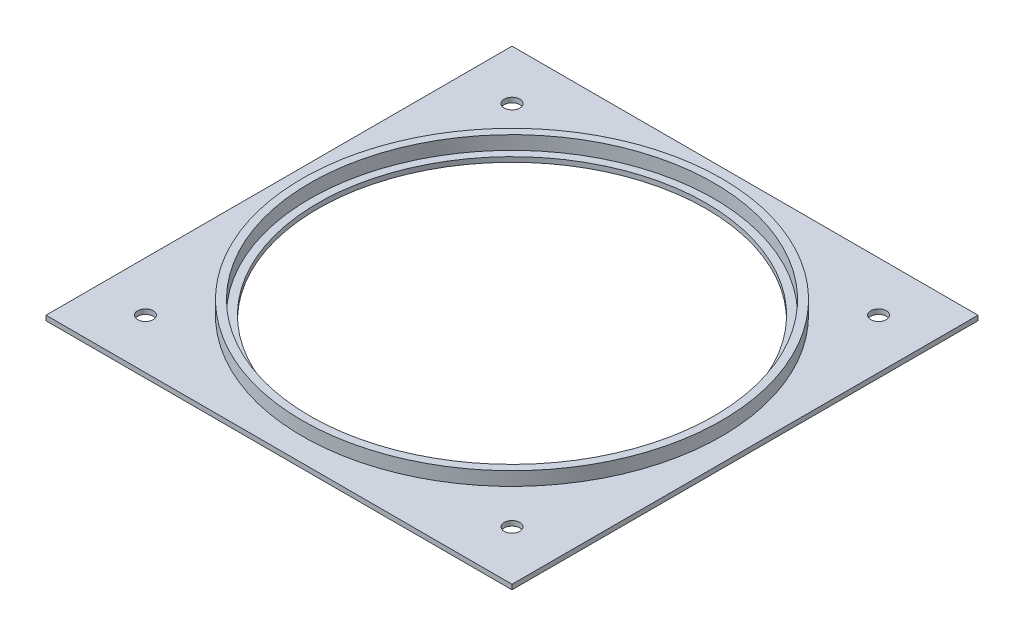
ISO-10303-21;
HEADER;
FILE_DESCRIPTION(('STEP AP214'),'2;1');
FILE_NAME('part.step','',(''),(''),'','','');
FILE_SCHEMA(('AUTOMOTIVE_DESIGN { 1 0 10303 214 1 1 1 1 }'));
ENDSEC;
DATA;
#1=APPLICATION_CONTEXT('core data for automotive mechanical design processes');
#2=APPLICATION_PROTOCOL_DEFINITION('international standard','automotive_design',2000,#1);
#3=PRODUCT_CONTEXT('',#1,'mechanical');
#4=PRODUCT('Part','Part','',(#3));
#5=PRODUCT_RELATED_PRODUCT_CATEGORY('part','',(#4));
#6=PRODUCT_DEFINITION_FORMATION('','',#4);
#7=PRODUCT_DEFINITION_CONTEXT('part definition',#1,'design');
#8=PRODUCT_DEFINITION('design','',#6,#7);
#9=PRODUCT_DEFINITION_SHAPE('','',#8);
#10=(LENGTH_UNIT() NAMED_UNIT(*) SI_UNIT(.MILLI.,.METRE.));
#11=(NAMED_UNIT(*) PLANE_ANGLE_UNIT() SI_UNIT($,.RADIAN.));
#12=(NAMED_UNIT(*) SI_UNIT($,.STERADIAN.) SOLID_ANGLE_UNIT());
#13=UNCERTAINTY_MEASURE_WITH_UNIT(LENGTH_MEASURE(1.E-05),#10,'distance_accuracy_value','');
#14=(GEOMETRIC_REPRESENTATION_CONTEXT(3) GLOBAL_UNCERTAINTY_ASSIGNED_CONTEXT((#13)) GLOBAL_UNIT_ASSIGNED_CONTEXT((#10,
#11,#12)) REPRESENTATION_CONTEXT('',''));
#15=CARTESIAN_POINT('',(0.,0.,0.));
#16=DIRECTION('',(0.,0.,1.));
#17=DIRECTION('',(1.,0.,0.));
#18=AXIS2_PLACEMENT_3D('',#15,#16,#17);
#19=CARTESIAN_POINT('',(0.,1.5875,0.));
#20=DIRECTION('',(0.,-1.,0.));
#21=DIRECTION('',(0.,0.,-1.));
#22=AXIS2_PLACEMENT_3D('',#19,#20,#21);
#23=PLANE('',#22);
#24=CARTESIAN_POINT('',(0.,1.5875,0.));
#25=DIRECTION('',(0.,1.,0.));
#26=DIRECTION('',(0.,0.,1.));
#27=AXIS2_PLACEMENT_3D('',#24,#25,#26);
#28=CIRCLE('',#27,63.5);
#29=CARTESIAN_POINT('',(0.,1.5875,63.5));
#30=VERTEX_POINT('',#29);
#31=EDGE_CURVE('E110',#30,#30,#28,.T.);
#32=ORIENTED_EDGE('',*,*,#31,.F.);
#33=EDGE_LOOP('',(#32));
#34=FACE_BOUND('',#33,.T.);
#35=CARTESIAN_POINT('',(0.,1.5875,0.));
#36=DIRECTION('',(0.,1.,0.));
#37=DIRECTION('',(0.,0.,1.));
#38=AXIS2_PLACEMENT_3D('',#35,#36,#37);
#39=CIRCLE('',#38,66.04);
#40=CARTESIAN_POINT('',(0.,1.5875,66.04));
#41=VERTEX_POINT('',#40);
#42=EDGE_CURVE('E173',#41,#41,#39,.T.);
#43=ORIENTED_EDGE('',*,*,#42,.T.);
#44=EDGE_LOOP('',(#43));
#45=FACE_BOUND('',#44,.T.);
#46=ADVANCED_FACE('F39',(#34,#45),#23,.F.);
#47=CARTESIAN_POINT('',(0.,1.5875,0.));
#48=DIRECTION('',(0.,-1.,0.));
#49=DIRECTION('',(0.,0.,-1.));
#50=AXIS2_PLACEMENT_3D('',#47,#48,#49);
#51=CIRCLE('',#50,68.58);
#52=CARTESIAN_POINT('',(0.,1.5875,-68.58));
#53=VERTEX_POINT('',#52);
#54=EDGE_CURVE('E11',#53,#53,#51,.F.);
#55=ORIENTED_EDGE('',*,*,#54,.F.);
#56=EDGE_LOOP('',(#55));
#57=FACE_BOUND('',#56,.T.);
#58=DIRECTION('',(0.,0.,-1.));
#59=VECTOR('',#58,1.);
#60=CARTESIAN_POINT('',(76.2,1.5875,76.2));
#61=LINE('',#60,#59);
#62=CARTESIAN_POINT('',(76.2,1.5875,76.2));
#63=VERTEX_POINT('',#62);
#64=CARTESIAN_POINT('',(76.2,1.5875,-76.2));
#65=VERTEX_POINT('',#64);
#66=EDGE_CURVE('E93',#63,#65,#61,.T.);
#67=ORIENTED_EDGE('',*,*,#66,.T.);
#68=DIRECTION('',(-1.,0.,0.));
#69=VECTOR('',#68,1.);
#70=CARTESIAN_POINT('',(-76.2,1.5875,-76.2));
#71=LINE('',#70,#69);
#72=CARTESIAN_POINT('',(-76.2,1.5875,-76.2));
#73=VERTEX_POINT('',#72);
#74=EDGE_CURVE('E87',#65,#73,#71,.T.);
#75=ORIENTED_EDGE('',*,*,#74,.T.);
#76=DIRECTION('',(0.,0.,1.));
#77=VECTOR('',#76,1.);
#78=CARTESIAN_POINT('',(-76.2,1.5875,76.2));
#79=LINE('',#78,#77);
#80=CARTESIAN_POINT('',(-76.2,1.5875,76.2));
#81=VERTEX_POINT('',#80);
#82=EDGE_CURVE('E91',#73,#81,#79,.T.);
#83=ORIENTED_EDGE('',*,*,#82,.T.);
#84=DIRECTION('',(1.,0.,0.));
#85=VECTOR('',#84,1.);
#86=CARTESIAN_POINT('',(-76.2,1.5875,76.2));
#87=LINE('',#86,#85);
#88=EDGE_CURVE('E56',#81,#63,#87,.T.);
#89=ORIENTED_EDGE('',*,*,#88,.T.);
#90=EDGE_LOOP('',(#67,#75,#83,#89));
#91=FACE_BOUND('',#90,.T.);
#92=CARTESIAN_POINT('',(-59.944,1.5875,-59.944));
#93=DIRECTION('',(0.,1.,0.));
#94=DIRECTION('',(0.,0.,1.));
#95=AXIS2_PLACEMENT_3D('',#92,#93,#94);
#96=CIRCLE('',#95,2.54);
#97=CARTESIAN_POINT('',(-59.944,1.5875,-57.404));
#98=VERTEX_POINT('',#97);
#99=EDGE_CURVE('E156',#98,#98,#96,.T.);
#100=ORIENTED_EDGE('',*,*,#99,.F.);
#101=EDGE_LOOP('',(#100));
#102=FACE_BOUND('',#101,.T.);
#103=CARTESIAN_POINT('',(59.944,1.5875,-59.944));
#104=DIRECTION('',(0.,1.,0.));
#105=DIRECTION('',(0.,0.,1.));
#106=AXIS2_PLACEMENT_3D('',#103,#104,#105);
#107=CIRCLE('',#106,2.54);
#108=CARTESIAN_POINT('',(59.944,1.5875,-57.404));
#109=VERTEX_POINT('',#108);
#110=EDGE_CURVE('E151',#109,#109,#107,.T.);
#111=ORIENTED_EDGE('',*,*,#110,.F.);
#112=EDGE_LOOP('',(#111));
#113=FACE_BOUND('',#112,.T.);
#114=CARTESIAN_POINT('',(59.944,1.5875,59.944));
#115=DIRECTION('',(0.,1.,0.));
#116=DIRECTION('',(0.,0.,1.));
#117=AXIS2_PLACEMENT_3D('',#114,#115,#116);
#118=CIRCLE('',#117,2.54);
#119=CARTESIAN_POINT('',(59.944,1.5875,62.484));
#120=VERTEX_POINT('',#119);
#121=EDGE_CURVE('E146',#120,#120,#118,.T.);
#122=ORIENTED_EDGE('',*,*,#121,.F.);
#123=EDGE_LOOP('',(#122));
#124=FACE_BOUND('',#123,.T.);
#125=CARTESIAN_POINT('',(-59.944,1.5875,59.944));
#126=DIRECTION('',(0.,1.,0.));
#127=DIRECTION('',(0.,0.,1.));
#128=AXIS2_PLACEMENT_3D('',#125,#126,#127);
#129=CIRCLE('',#128,2.54);
#130=CARTESIAN_POINT('',(-59.944,1.5875,62.484));
#131=VERTEX_POINT('',#130);
#132=EDGE_CURVE('E135',#131,#131,#129,.T.);
#133=ORIENTED_EDGE('',*,*,#132,.F.);
#134=EDGE_LOOP('',(#133));
#135=FACE_BOUND('',#134,.T.);
#136=ADVANCED_FACE('F88',(#57,#91,#102,#113,#124,#135),#23,.F.);
#137=CARTESIAN_POINT('',(0.,0.,0.));
#138=DIRECTION('',(0.,-1.,0.));
#139=DIRECTION('',(0.,0.,-1.));
#140=AXIS2_PLACEMENT_3D('',#137,#138,#139);
#141=PLANE('',#140);
#142=CARTESIAN_POINT('',(59.944,0.,59.944));
#143=DIRECTION('',(0.,1.,0.));
#144=DIRECTION('',(0.,0.,1.));
#145=AXIS2_PLACEMENT_3D('',#142,#143,#144);
#146=CIRCLE('',#145,2.54);
#147=CARTESIAN_POINT('',(59.944,0.,62.484));
#148=VERTEX_POINT('',#147);
#149=EDGE_CURVE('E139',#148,#148,#146,.T.);
#150=ORIENTED_EDGE('',*,*,#149,.T.);
#151=EDGE_LOOP('',(#150));
#152=FACE_BOUND('',#151,.T.);
#153=CARTESIAN_POINT('',(-59.944,0.,-59.944));
#154=DIRECTION('',(0.,1.,0.));
#155=DIRECTION('',(0.,0.,1.));
#156=AXIS2_PLACEMENT_3D('',#153,#154,#155);
#157=CIRCLE('',#156,2.54);
#158=CARTESIAN_POINT('',(-59.944,0.,-57.404));
#159=VERTEX_POINT('',#158);
#160=EDGE_CURVE('E154',#159,#159,#157,.T.);
#161=ORIENTED_EDGE('',*,*,#160,.T.);
#162=EDGE_LOOP('',(#161));
#163=FACE_BOUND('',#162,.T.);
#164=DIRECTION('',(0.,0.,-1.));
#165=VECTOR('',#164,1.);
#166=CARTESIAN_POINT('',(76.2,0.,76.2));
#167=LINE('',#166,#165);
#168=CARTESIAN_POINT('',(76.2,0.,76.2));
#169=VERTEX_POINT('',#168);
#170=CARTESIAN_POINT('',(76.2,0.,-76.2));
#171=VERTEX_POINT('',#170);
#172=EDGE_CURVE('E107',#169,#171,#167,.T.);
#173=ORIENTED_EDGE('',*,*,#172,.F.);
#174=DIRECTION('',(1.,0.,0.));
#175=VECTOR('',#174,1.);
#176=CARTESIAN_POINT('',(-76.2,0.,76.2));
#177=LINE('',#176,#175);
#178=CARTESIAN_POINT('',(-76.2,0.,76.2));
#179=VERTEX_POINT('',#178);
#180=EDGE_CURVE('E79',#179,#169,#177,.T.);
#181=ORIENTED_EDGE('',*,*,#180,.F.);
#182=DIRECTION('',(0.,0.,1.));
#183=VECTOR('',#182,1.);
#184=CARTESIAN_POINT('',(-76.2,0.,76.2));
#185=LINE('',#184,#183);
#186=CARTESIAN_POINT('',(-76.2,0.,-76.2));
#187=VERTEX_POINT('',#186);
#188=EDGE_CURVE('E73',#187,#179,#185,.T.);
#189=ORIENTED_EDGE('',*,*,#188,.F.);
#190=DIRECTION('',(-1.,0.,0.));
#191=VECTOR('',#190,1.);
#192=CARTESIAN_POINT('',(-76.2,0.,-76.2));
#193=LINE('',#192,#191);
#194=EDGE_CURVE('E98',#171,#187,#193,.T.);
#195=ORIENTED_EDGE('',*,*,#194,.F.);
#196=EDGE_LOOP('',(#173,#181,#189,#195));
#197=FACE_BOUND('',#196,.T.);
#198=CARTESIAN_POINT('',(0.,0.,0.));
#199=DIRECTION('',(0.,1.,0.));
#200=DIRECTION('',(0.,0.,1.));
#201=AXIS2_PLACEMENT_3D('',#198,#199,#200);
#202=CIRCLE('',#201,63.5);
#203=CARTESIAN_POINT('',(0.,0.,63.5));
#204=VERTEX_POINT('',#203);
#205=EDGE_CURVE('E126',#204,#204,#202,.T.);
#206=ORIENTED_EDGE('',*,*,#205,.T.);
#207=EDGE_LOOP('',(#206));
#208=FACE_BOUND('',#207,.T.);
#209=CARTESIAN_POINT('',(59.944,0.,-59.944));
#210=DIRECTION('',(0.,1.,0.));
#211=DIRECTION('',(0.,0.,1.));
#212=AXIS2_PLACEMENT_3D('',#209,#210,#211);
#213=CIRCLE('',#212,2.54);
#214=CARTESIAN_POINT('',(59.944,0.,-57.404));
#215=VERTEX_POINT('',#214);
#216=EDGE_CURVE('E130',#215,#215,#213,.T.);
#217=ORIENTED_EDGE('',*,*,#216,.T.);
#218=EDGE_LOOP('',(#217));
#219=FACE_BOUND('',#218,.T.);
#220=CARTESIAN_POINT('',(-59.944,0.,59.944));
#221=DIRECTION('',(0.,1.,0.));
#222=DIRECTION('',(0.,0.,1.));
#223=AXIS2_PLACEMENT_3D('',#220,#221,#222);
#224=CIRCLE('',#223,2.54);
#225=CARTESIAN_POINT('',(-59.944,0.,62.484));
#226=VERTEX_POINT('',#225);
#227=EDGE_CURVE('E133',#226,#226,#224,.T.);
#228=ORIENTED_EDGE('',*,*,#227,.T.);
#229=EDGE_LOOP('',(#228));
#230=FACE_BOUND('',#229,.T.);
#231=ADVANCED_FACE('F118',(#152,#163,#197,#208,#219,#230),#141,.T.);
#232=CARTESIAN_POINT('',(76.2,1.5875,76.2));
#233=DIRECTION('',(-1.,0.,0.));
#234=DIRECTION('',(0.,0.,1.));
#235=AXIS2_PLACEMENT_3D('',#232,#233,#234);
#236=PLANE('',#235);
#237=ORIENTED_EDGE('',*,*,#172,.T.);
#238=DIRECTION('',(0.,-1.,0.));
#239=VECTOR('',#238,1.);
#240=CARTESIAN_POINT('',(76.2,1.5875,-76.2));
#241=LINE('',#240,#239);
#242=EDGE_CURVE('E48',#65,#171,#241,.T.);
#243=ORIENTED_EDGE('',*,*,#242,.F.);
#244=ORIENTED_EDGE('',*,*,#66,.F.);
#245=DIRECTION('',(0.,-1.,0.));
#246=VECTOR('',#245,1.);
#247=CARTESIAN_POINT('',(76.2,1.5875,76.2));
#248=LINE('',#247,#246);
#249=EDGE_CURVE('E103',#63,#169,#248,.T.);
#250=ORIENTED_EDGE('',*,*,#249,.T.);
#251=EDGE_LOOP('',(#237,#243,#244,#250));
#252=FACE_BOUND('',#251,.T.);
#253=ADVANCED_FACE('F41',(#252),#236,.F.);
#254=CARTESIAN_POINT('',(-76.2,1.5875,-76.2));
#255=DIRECTION('',(0.,0.,1.));
#256=DIRECTION('',(1.,0.,0.));
#257=AXIS2_PLACEMENT_3D('',#254,#255,#256);
#258=PLANE('',#257);
#259=ORIENTED_EDGE('',*,*,#194,.T.);
#260=DIRECTION('',(0.,-1.,0.));
#261=VECTOR('',#260,1.);
#262=CARTESIAN_POINT('',(-76.2,1.5875,-76.2));
#263=LINE('',#262,#261);
#264=EDGE_CURVE('E96',#73,#187,#263,.T.);
#265=ORIENTED_EDGE('',*,*,#264,.F.);
#266=ORIENTED_EDGE('',*,*,#74,.F.);
#267=ORIENTED_EDGE('',*,*,#242,.T.);
#268=EDGE_LOOP('',(#259,#265,#266,#267));
#269=FACE_BOUND('',#268,.T.);
#270=ADVANCED_FACE('F97',(#269),#258,.F.);
#271=CARTESIAN_POINT('',(-76.2,1.5875,76.2));
#272=DIRECTION('',(1.,0.,0.));
#273=DIRECTION('',(0.,0.,-1.));
#274=AXIS2_PLACEMENT_3D('',#271,#272,#273);
#275=PLANE('',#274);
#276=ORIENTED_EDGE('',*,*,#188,.T.);
#277=DIRECTION('',(0.,-1.,0.));
#278=VECTOR('',#277,1.);
#279=CARTESIAN_POINT('',(-76.2,1.5875,76.2));
#280=LINE('',#279,#278);
#281=EDGE_CURVE('E99',#81,#179,#280,.T.);
#282=ORIENTED_EDGE('',*,*,#281,.F.);
#283=ORIENTED_EDGE('',*,*,#82,.F.);
#284=ORIENTED_EDGE('',*,*,#264,.T.);
#285=EDGE_LOOP('',(#276,#282,#283,#284));
#286=FACE_BOUND('',#285,.T.);
#287=ADVANCED_FACE('F101',(#286),#275,.F.);
#288=CARTESIAN_POINT('',(-76.2,1.5875,76.2));
#289=DIRECTION('',(0.,0.,-1.));
#290=DIRECTION('',(-1.,0.,0.));
#291=AXIS2_PLACEMENT_3D('',#288,#289,#290);
#292=PLANE('',#291);
#293=ORIENTED_EDGE('',*,*,#180,.T.);
#294=ORIENTED_EDGE('',*,*,#249,.F.);
#295=ORIENTED_EDGE('',*,*,#88,.F.);
#296=ORIENTED_EDGE('',*,*,#281,.T.);
#297=EDGE_LOOP('',(#293,#294,#295,#296));
#298=FACE_BOUND('',#297,.T.);
#299=ADVANCED_FACE('F199',(#298),#292,.F.);
#300=CARTESIAN_POINT('',(0.,1.5875,0.));
#301=DIRECTION('',(0.,-1.,0.));
#302=DIRECTION('',(0.,0.,-1.));
#303=AXIS2_PLACEMENT_3D('',#300,#301,#302);
#304=CYLINDRICAL_SURFACE('',#303,63.5);
#305=ORIENTED_EDGE('',*,*,#31,.T.);
#306=EDGE_LOOP('',(#305));
#307=FACE_BOUND('',#306,.T.);
#308=ORIENTED_EDGE('',*,*,#205,.F.);
#309=EDGE_LOOP('',(#308));
#310=FACE_BOUND('',#309,.T.);
#311=ADVANCED_FACE('F165',(#307,#310),#304,.F.);
#312=CARTESIAN_POINT('',(-59.944,1.5875,-59.944));
#313=DIRECTION('',(0.,-1.,0.));
#314=DIRECTION('',(0.,0.,-1.));
#315=AXIS2_PLACEMENT_3D('',#312,#313,#314);
#316=CYLINDRICAL_SURFACE('',#315,2.54);
#317=ORIENTED_EDGE('',*,*,#99,.T.);
#318=EDGE_LOOP('',(#317));
#319=FACE_BOUND('',#318,.T.);
#320=ORIENTED_EDGE('',*,*,#160,.F.);
#321=EDGE_LOOP('',(#320));
#322=FACE_BOUND('',#321,.T.);
#323=ADVANCED_FACE('F254',(#319,#322),#316,.F.);
#324=CARTESIAN_POINT('',(59.944,1.5875,-59.944));
#325=DIRECTION('',(0.,-1.,0.));
#326=DIRECTION('',(0.,0.,-1.));
#327=AXIS2_PLACEMENT_3D('',#324,#325,#326);
#328=CYLINDRICAL_SURFACE('',#327,2.54);
#329=ORIENTED_EDGE('',*,*,#110,.T.);
#330=EDGE_LOOP('',(#329));
#331=FACE_BOUND('',#330,.T.);
#332=ORIENTED_EDGE('',*,*,#216,.F.);
#333=EDGE_LOOP('',(#332));
#334=FACE_BOUND('',#333,.T.);
#335=ADVANCED_FACE('F263',(#331,#334),#328,.F.);
#336=CARTESIAN_POINT('',(59.944,1.5875,59.944));
#337=DIRECTION('',(0.,-1.,0.));
#338=DIRECTION('',(0.,0.,-1.));
#339=AXIS2_PLACEMENT_3D('',#336,#337,#338);
#340=CYLINDRICAL_SURFACE('',#339,2.54);
#341=ORIENTED_EDGE('',*,*,#121,.T.);
#342=EDGE_LOOP('',(#341));
#343=FACE_BOUND('',#342,.T.);
#344=ORIENTED_EDGE('',*,*,#149,.F.);
#345=EDGE_LOOP('',(#344));
#346=FACE_BOUND('',#345,.T.);
#347=ADVANCED_FACE('F273',(#343,#346),#340,.F.);
#348=CARTESIAN_POINT('',(-59.944,1.5875,59.944));
#349=DIRECTION('',(0.,-1.,0.));
#350=DIRECTION('',(0.,0.,-1.));
#351=AXIS2_PLACEMENT_3D('',#348,#349,#350);
#352=CYLINDRICAL_SURFACE('',#351,2.54);
#353=ORIENTED_EDGE('',*,*,#132,.T.);
#354=EDGE_LOOP('',(#353));
#355=FACE_BOUND('',#354,.T.);
#356=ORIENTED_EDGE('',*,*,#227,.F.);
#357=EDGE_LOOP('',(#356));
#358=FACE_BOUND('',#357,.T.);
#359=ADVANCED_FACE('F284',(#355,#358),#352,.F.);
#360=CARTESIAN_POINT('',(0.,6.0325,0.));
#361=DIRECTION('',(0.,-1.,0.));
#362=DIRECTION('',(0.,0.,-1.));
#363=AXIS2_PLACEMENT_3D('',#360,#361,#362);
#364=CYLINDRICAL_SURFACE('',#363,66.04);
#365=CARTESIAN_POINT('',(0.,6.0325,0.));
#366=DIRECTION('',(0.,1.,0.));
#367=DIRECTION('',(0.,0.,1.));
#368=AXIS2_PLACEMENT_3D('',#365,#366,#367);
#369=CIRCLE('',#368,66.04);
#370=CARTESIAN_POINT('',(0.,6.0325,66.04));
#371=VERTEX_POINT('',#370);
#372=EDGE_CURVE('E142',#371,#371,#369,.T.);
#373=ORIENTED_EDGE('',*,*,#372,.T.);
#374=EDGE_LOOP('',(#373));
#375=FACE_BOUND('',#374,.T.);
#376=ORIENTED_EDGE('',*,*,#42,.F.);
#377=EDGE_LOOP('',(#376));
#378=FACE_BOUND('',#377,.T.);
#379=ADVANCED_FACE('F179',(#375,#378),#364,.F.);
#380=CARTESIAN_POINT('',(0.,6.0325,0.));
#381=DIRECTION('',(0.,-1.,0.));
#382=DIRECTION('',(0.,0.,-1.));
#383=AXIS2_PLACEMENT_3D('',#380,#381,#382);
#384=CYLINDRICAL_SURFACE('',#383,68.58);
#385=CARTESIAN_POINT('',(0.,6.0325,0.));
#386=DIRECTION('',(0.,1.,0.));
#387=DIRECTION('',(0.,0.,1.));
#388=AXIS2_PLACEMENT_3D('',#385,#386,#387);
#389=CIRCLE('',#388,68.58);
#390=CARTESIAN_POINT('',(0.,6.0325,68.58));
#391=VERTEX_POINT('',#390);
#392=EDGE_CURVE('E136',#391,#391,#389,.T.);
#393=ORIENTED_EDGE('',*,*,#392,.F.);
#394=EDGE_LOOP('',(#393));
#395=FACE_BOUND('',#394,.T.);
#396=ORIENTED_EDGE('',*,*,#54,.T.);
#397=EDGE_LOOP('',(#396));
#398=FACE_BOUND('',#397,.T.);
#399=ADVANCED_FACE('F184',(#395,#398),#384,.T.);
#400=CARTESIAN_POINT('',(0.,6.0325,0.));
#401=DIRECTION('',(0.,1.,0.));
#402=DIRECTION('',(0.,0.,1.));
#403=AXIS2_PLACEMENT_3D('',#400,#401,#402);
#404=PLANE('',#403);
#405=ORIENTED_EDGE('',*,*,#372,.F.);
#406=EDGE_LOOP('',(#405));
#407=FACE_BOUND('',#406,.T.);
#408=ORIENTED_EDGE('',*,*,#392,.T.);
#409=EDGE_LOOP('',(#408));
#410=FACE_BOUND('',#409,.T.);
#411=ADVANCED_FACE('F181',(#407,#410),#404,.T.);
#412=CLOSED_SHELL('',(#46,#136,#231,#253,#270,#287,#299,#311,#323,#335,#347,#359,#379,#399,#411));
#413=MANIFOLD_SOLID_BREP('B2',#412);
#414=ADVANCED_BREP_SHAPE_REPRESENTATION('',(#18,#413),#14);
#415=SHAPE_DEFINITION_REPRESENTATION(#9,#414);
ENDSEC;
END-ISO-10303-21;
